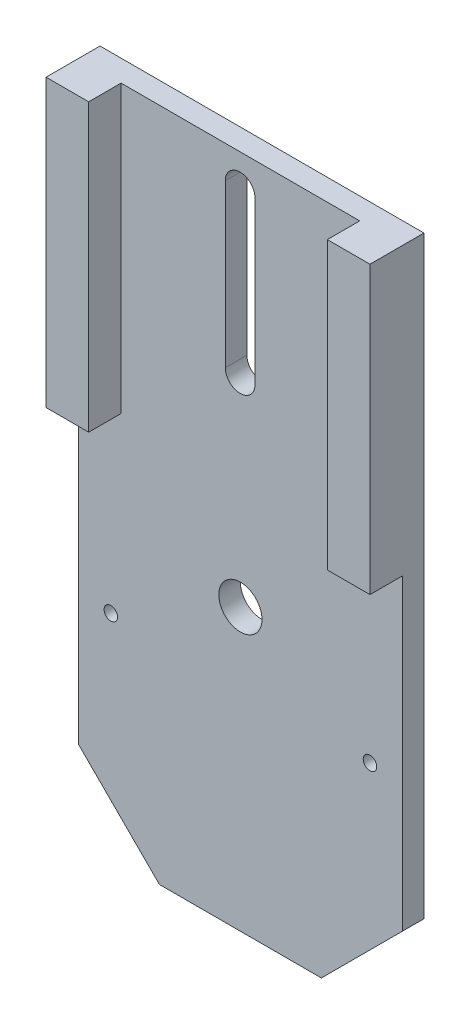
ISO-10303-21;
HEADER;
FILE_DESCRIPTION(('STEP AP214'),'2;1');
FILE_NAME('part.step','',(''),(''),'','','');
FILE_SCHEMA(('AUTOMOTIVE_DESIGN { 1 0 10303 214 1 1 1 1 }'));
ENDSEC;
DATA;
#1=APPLICATION_CONTEXT('core data for automotive mechanical design processes');
#2=APPLICATION_PROTOCOL_DEFINITION('international standard','automotive_design',2000,#1);
#3=PRODUCT_CONTEXT('',#1,'mechanical');
#4=PRODUCT('Part','Part','',(#3));
#5=PRODUCT_RELATED_PRODUCT_CATEGORY('part','',(#4));
#6=PRODUCT_DEFINITION_FORMATION('','',#4);
#7=PRODUCT_DEFINITION_CONTEXT('part definition',#1,'design');
#8=PRODUCT_DEFINITION('design','',#6,#7);
#9=PRODUCT_DEFINITION_SHAPE('','',#8);
#10=(LENGTH_UNIT() NAMED_UNIT(*) SI_UNIT(.MILLI.,.METRE.));
#11=(NAMED_UNIT(*) PLANE_ANGLE_UNIT() SI_UNIT($,.RADIAN.));
#12=(NAMED_UNIT(*) SI_UNIT($,.STERADIAN.) SOLID_ANGLE_UNIT());
#13=UNCERTAINTY_MEASURE_WITH_UNIT(LENGTH_MEASURE(1.E-05),#10,'distance_accuracy_value','');
#14=(GEOMETRIC_REPRESENTATION_CONTEXT(3) GLOBAL_UNCERTAINTY_ASSIGNED_CONTEXT((#13)) GLOBAL_UNIT_ASSIGNED_CONTEXT((#10,
#11,#12)) REPRESENTATION_CONTEXT('',''));
#15=CARTESIAN_POINT('',(0.,0.,0.));
#16=DIRECTION('',(0.,0.,1.));
#17=DIRECTION('',(1.,0.,0.));
#18=AXIS2_PLACEMENT_3D('',#15,#16,#17);
#19=CARTESIAN_POINT('',(0.,125.,10.));
#20=DIRECTION('',(0.,0.,-1.));
#21=DIRECTION('',(-1.,0.,0.));
#22=AXIS2_PLACEMENT_3D('',#19,#20,#21);
#23=PLANE('',#22);
#24=DIRECTION('',(-1.,0.,0.));
#25=VECTOR('',#24,1.);
#26=CARTESIAN_POINT('',(60.,72.,10.));
#27=LINE('',#26,#25);
#28=CARTESIAN_POINT('',(7.9,72.,10.));
#29=VERTEX_POINT('',#28);
#30=CARTESIAN_POINT('',(0.,72.,10.));
#31=VERTEX_POINT('',#30);
#32=EDGE_CURVE('E212',#29,#31,#27,.T.);
#33=ORIENTED_EDGE('',*,*,#32,.F.);
#34=DIRECTION('',(0.,1.,0.));
#35=VECTOR('',#34,1.);
#36=CARTESIAN_POINT('',(7.9,70.,10.));
#37=LINE('',#36,#35);
#38=CARTESIAN_POINT('',(7.9,125.,10.));
#39=VERTEX_POINT('',#38);
#40=EDGE_CURVE('E183',#29,#39,#37,.T.);
#41=ORIENTED_EDGE('',*,*,#40,.T.);
#42=DIRECTION('',(-1.,0.,0.));
#43=VECTOR('',#42,1.);
#44=CARTESIAN_POINT('',(0.,125.,10.));
#45=LINE('',#44,#43);
#46=CARTESIAN_POINT('',(0.,125.,10.));
#47=VERTEX_POINT('',#46);
#48=EDGE_CURVE('E238',#39,#47,#45,.T.);
#49=ORIENTED_EDGE('',*,*,#48,.T.);
#50=DIRECTION('',(0.,-1.,0.));
#51=VECTOR('',#50,1.);
#52=CARTESIAN_POINT('',(0.,0.,10.));
#53=LINE('',#52,#51);
#54=EDGE_CURVE('E232',#47,#31,#53,.T.);
#55=ORIENTED_EDGE('',*,*,#54,.T.);
#56=EDGE_LOOP('',(#33,#41,#49,#55));
#57=FACE_BOUND('',#56,.T.);
#58=ADVANCED_FACE('F34',(#57),#23,.F.);
#59=CARTESIAN_POINT('',(60.,72.,10.));
#60=DIRECTION('',(0.,1.,0.));
#61=DIRECTION('',(0.,0.,1.));
#62=AXIS2_PLACEMENT_3D('',#59,#60,#61);
#63=PLANE('',#62);
#64=DIRECTION('',(-1.,0.,0.));
#65=VECTOR('',#64,1.);
#66=CARTESIAN_POINT('',(60.,72.,4.));
#67=LINE('',#66,#65);
#68=CARTESIAN_POINT('',(7.9,72.,4.));
#69=VERTEX_POINT('',#68);
#70=CARTESIAN_POINT('',(0.,72.,4.));
#71=VERTEX_POINT('',#70);
#72=EDGE_CURVE('E224',#69,#71,#67,.T.);
#73=ORIENTED_EDGE('',*,*,#72,.F.);
#74=DIRECTION('',(0.,0.,1.));
#75=VECTOR('',#74,1.);
#76=CARTESIAN_POINT('',(7.9,72.,10.));
#77=LINE('',#76,#75);
#78=EDGE_CURVE('E279',#69,#29,#77,.T.);
#79=ORIENTED_EDGE('',*,*,#78,.T.);
#80=ORIENTED_EDGE('',*,*,#32,.T.);
#81=DIRECTION('',(0.,0.,-1.));
#82=VECTOR('',#81,1.);
#83=CARTESIAN_POINT('',(0.,72.,10.));
#84=LINE('',#83,#82);
#85=EDGE_CURVE('E204',#31,#71,#84,.T.);
#86=ORIENTED_EDGE('',*,*,#85,.T.);
#87=EDGE_LOOP('',(#73,#79,#80,#86));
#88=FACE_BOUND('',#87,.T.);
#89=ADVANCED_FACE('F305',(#88),#63,.F.);
#90=CARTESIAN_POINT('',(0.,0.,10.));
#91=DIRECTION('',(1.,0.,0.));
#92=DIRECTION('',(0.,0.,-1.));
#93=AXIS2_PLACEMENT_3D('',#90,#91,#92);
#94=PLANE('',#93);
#95=DIRECTION('',(0.,-1.,0.));
#96=VECTOR('',#95,1.);
#97=CARTESIAN_POINT('',(0.,0.,0.));
#98=LINE('',#97,#96);
#99=CARTESIAN_POINT('',(0.,125.,0.));
#100=VERTEX_POINT('',#99);
#101=CARTESIAN_POINT('',(0.,15.0000000000001,0.));
#102=VERTEX_POINT('',#101);
#103=EDGE_CURVE('E231',#100,#102,#98,.T.);
#104=ORIENTED_EDGE('',*,*,#103,.T.);
#105=DIRECTION('',(0.,0.,1.));
#106=VECTOR('',#105,1.);
#107=CARTESIAN_POINT('',(0.,15.0000000000001,10.));
#108=LINE('',#107,#106);
#109=CARTESIAN_POINT('',(0.,15.0000000000001,4.));
#110=VERTEX_POINT('',#109);
#111=EDGE_CURVE('E267',#102,#110,#108,.T.);
#112=ORIENTED_EDGE('',*,*,#111,.T.);
#113=DIRECTION('',(0.,-1.,0.));
#114=VECTOR('',#113,1.);
#115=CARTESIAN_POINT('',(0.,0.,4.));
#116=LINE('',#115,#114);
#117=EDGE_CURVE('E209',#71,#110,#116,.T.);
#118=ORIENTED_EDGE('',*,*,#117,.F.);
#119=ORIENTED_EDGE('',*,*,#85,.F.);
#120=ORIENTED_EDGE('',*,*,#54,.F.);
#121=DIRECTION('',(0.,0.,-1.));
#122=VECTOR('',#121,1.);
#123=CARTESIAN_POINT('',(0.,125.,10.));
#124=LINE('',#123,#122);
#125=EDGE_CURVE('E242',#47,#100,#124,.T.);
#126=ORIENTED_EDGE('',*,*,#125,.T.);
#127=EDGE_LOOP('',(#104,#112,#118,#119,#120,#126));
#128=FACE_BOUND('',#127,.T.);
#129=ADVANCED_FACE('F312',(#128),#94,.F.);
#130=CARTESIAN_POINT('',(0.,0.,10.));
#131=DIRECTION('',(0.,1.,0.));
#132=DIRECTION('',(0.,0.,1.));
#133=AXIS2_PLACEMENT_3D('',#130,#131,#132);
#134=PLANE('',#133);
#135=DIRECTION('',(-1.,0.,0.));
#136=VECTOR('',#135,1.);
#137=CARTESIAN_POINT('',(60.,0.,4.));
#138=LINE('',#137,#136);
#139=CARTESIAN_POINT('',(44.9999999999999,0.,4.));
#140=VERTEX_POINT('',#139);
#141=CARTESIAN_POINT('',(15.,0.,4.));
#142=VERTEX_POINT('',#141);
#143=EDGE_CURVE('E217',#140,#142,#138,.T.);
#144=ORIENTED_EDGE('',*,*,#143,.T.);
#145=DIRECTION('',(0.,0.,-1.));
#146=VECTOR('',#145,1.);
#147=CARTESIAN_POINT('',(15.,0.,10.));
#148=LINE('',#147,#146);
#149=CARTESIAN_POINT('',(15.,0.,0.));
#150=VERTEX_POINT('',#149);
#151=EDGE_CURVE('E260',#142,#150,#148,.T.);
#152=ORIENTED_EDGE('',*,*,#151,.T.);
#153=DIRECTION('',(1.,0.,0.));
#154=VECTOR('',#153,1.);
#155=CARTESIAN_POINT('',(0.,0.,0.));
#156=LINE('',#155,#154);
#157=CARTESIAN_POINT('',(44.9999999999999,0.,0.));
#158=VERTEX_POINT('',#157);
#159=EDGE_CURVE('E245',#150,#158,#156,.T.);
#160=ORIENTED_EDGE('',*,*,#159,.T.);
#161=DIRECTION('',(0.,0.,1.));
#162=VECTOR('',#161,1.);
#163=CARTESIAN_POINT('',(44.9999999999999,0.,10.));
#164=LINE('',#163,#162);
#165=EDGE_CURVE('E256',#158,#140,#164,.T.);
#166=ORIENTED_EDGE('',*,*,#165,.T.);
#167=EDGE_LOOP('',(#144,#152,#160,#166));
#168=FACE_BOUND('',#167,.T.);
#169=ADVANCED_FACE('F365',(#168),#134,.F.);
#170=CARTESIAN_POINT('',(60.,0.,10.));
#171=DIRECTION('',(-1.,0.,0.));
#172=DIRECTION('',(0.,0.,1.));
#173=AXIS2_PLACEMENT_3D('',#170,#171,#172);
#174=PLANE('',#173);
#175=DIRECTION('',(0.,-1.,0.));
#176=VECTOR('',#175,1.);
#177=CARTESIAN_POINT('',(60.,0.,4.));
#178=LINE('',#177,#176);
#179=CARTESIAN_POINT('',(60.,72.,4.));
#180=VERTEX_POINT('',#179);
#181=CARTESIAN_POINT('',(60.,15.,4.));
#182=VERTEX_POINT('',#181);
#183=EDGE_CURVE('E208',#180,#182,#178,.T.);
#184=ORIENTED_EDGE('',*,*,#183,.T.);
#185=DIRECTION('',(0.,0.,-1.));
#186=VECTOR('',#185,1.);
#187=CARTESIAN_POINT('',(60.,15.,10.));
#188=LINE('',#187,#186);
#189=CARTESIAN_POINT('',(60.,15.,0.));
#190=VERTEX_POINT('',#189);
#191=EDGE_CURVE('E273',#182,#190,#188,.T.);
#192=ORIENTED_EDGE('',*,*,#191,.T.);
#193=DIRECTION('',(0.,1.,0.));
#194=VECTOR('',#193,1.);
#195=CARTESIAN_POINT('',(60.,0.,0.));
#196=LINE('',#195,#194);
#197=CARTESIAN_POINT('',(60.,125.,0.));
#198=VERTEX_POINT('',#197);
#199=EDGE_CURVE('E248',#190,#198,#196,.T.);
#200=ORIENTED_EDGE('',*,*,#199,.T.);
#201=DIRECTION('',(0.,0.,-1.));
#202=VECTOR('',#201,1.);
#203=CARTESIAN_POINT('',(60.,125.,10.));
#204=LINE('',#203,#202);
#205=CARTESIAN_POINT('',(60.,125.,10.));
#206=VERTEX_POINT('',#205);
#207=EDGE_CURVE('E253',#206,#198,#204,.T.);
#208=ORIENTED_EDGE('',*,*,#207,.F.);
#209=DIRECTION('',(0.,1.,0.));
#210=VECTOR('',#209,1.);
#211=CARTESIAN_POINT('',(60.,0.,10.));
#212=LINE('',#211,#210);
#213=CARTESIAN_POINT('',(60.,72.,10.));
#214=VERTEX_POINT('',#213);
#215=EDGE_CURVE('E235',#214,#206,#212,.T.);
#216=ORIENTED_EDGE('',*,*,#215,.F.);
#217=DIRECTION('',(0.,0.,-1.));
#218=VECTOR('',#217,1.);
#219=CARTESIAN_POINT('',(60.,72.,10.));
#220=LINE('',#219,#218);
#221=EDGE_CURVE('E205',#214,#180,#220,.T.);
#222=ORIENTED_EDGE('',*,*,#221,.T.);
#223=EDGE_LOOP('',(#184,#192,#200,#208,#216,#222));
#224=FACE_BOUND('',#223,.T.);
#225=ADVANCED_FACE('F327',(#224),#174,.F.);
#226=CARTESIAN_POINT('',(0.,125.,10.));
#227=DIRECTION('',(0.,-1.,0.));
#228=DIRECTION('',(0.,0.,-1.));
#229=AXIS2_PLACEMENT_3D('',#226,#227,#228);
#230=PLANE('',#229);
#231=ORIENTED_EDGE('',*,*,#48,.F.);
#232=DIRECTION('',(0.,0.,1.));
#233=VECTOR('',#232,1.);
#234=CARTESIAN_POINT('',(7.9,125.,10.));
#235=LINE('',#234,#233);
#236=CARTESIAN_POINT('',(7.9,125.,4.));
#237=VERTEX_POINT('',#236);
#238=EDGE_CURVE('E173',#237,#39,#235,.T.);
#239=ORIENTED_EDGE('',*,*,#238,.F.);
#240=DIRECTION('',(-1.,0.,0.));
#241=VECTOR('',#240,1.);
#242=CARTESIAN_POINT('',(7.9,125.,4.));
#243=LINE('',#242,#241);
#244=CARTESIAN_POINT('',(52.1,125.,4.));
#245=VERTEX_POINT('',#244);
#246=EDGE_CURVE('E180',#245,#237,#243,.T.);
#247=ORIENTED_EDGE('',*,*,#246,.F.);
#248=DIRECTION('',(0.,0.,-1.));
#249=VECTOR('',#248,1.);
#250=CARTESIAN_POINT('',(52.1,125.,10.));
#251=LINE('',#250,#249);
#252=CARTESIAN_POINT('',(52.1,125.,10.));
#253=VERTEX_POINT('',#252);
#254=EDGE_CURVE('E177',#253,#245,#251,.T.);
#255=ORIENTED_EDGE('',*,*,#254,.F.);
#256=EDGE_CURVE('E239',#206,#253,#45,.T.);
#257=ORIENTED_EDGE('',*,*,#256,.F.);
#258=ORIENTED_EDGE('',*,*,#207,.T.);
#259=DIRECTION('',(-1.,0.,0.));
#260=VECTOR('',#259,1.);
#261=CARTESIAN_POINT('',(0.,125.,0.));
#262=LINE('',#261,#260);
#263=EDGE_CURVE('E236',#198,#100,#262,.T.);
#264=ORIENTED_EDGE('',*,*,#263,.T.);
#265=ORIENTED_EDGE('',*,*,#125,.F.);
#266=EDGE_LOOP('',(#231,#239,#247,#255,#257,#258,#264,#265));
#267=FACE_BOUND('',#266,.T.);
#268=ADVANCED_FACE('F320',(#267),#230,.F.);
#269=ORIENTED_EDGE('',*,*,#256,.T.);
#270=DIRECTION('',(0.,1.,0.));
#271=VECTOR('',#270,1.);
#272=CARTESIAN_POINT('',(52.1,70.,10.));
#273=LINE('',#272,#271);
#274=CARTESIAN_POINT('',(52.1,72.,10.));
#275=VERTEX_POINT('',#274);
#276=EDGE_CURVE('E189',#275,#253,#273,.T.);
#277=ORIENTED_EDGE('',*,*,#276,.F.);
#278=EDGE_CURVE('E225',#214,#275,#27,.T.);
#279=ORIENTED_EDGE('',*,*,#278,.F.);
#280=ORIENTED_EDGE('',*,*,#215,.T.);
#281=EDGE_LOOP('',(#269,#277,#279,#280));
#282=FACE_BOUND('',#281,.T.);
#283=ADVANCED_FACE('F308',(#282),#23,.F.);
#284=CARTESIAN_POINT('',(0.,125.,0.));
#285=DIRECTION('',(0.,0.,-1.));
#286=DIRECTION('',(-1.,0.,0.));
#287=AXIS2_PLACEMENT_3D('',#284,#285,#286);
#288=PLANE('',#287);
#289=CARTESIAN_POINT('',(29.9525777419631,119.,0.));
#290=DIRECTION('',(0.,0.,-1.));
#291=DIRECTION('',(-1.,0.,0.));
#292=AXIS2_PLACEMENT_3D('',#289,#290,#291);
#293=CIRCLE('',#292,2.75);
#294=CARTESIAN_POINT('',(27.2025777419631,119.,0.));
#295=VERTEX_POINT('',#294);
#296=CARTESIAN_POINT('',(32.7025777419631,119.,0.));
#297=VERTEX_POINT('',#296);
#298=EDGE_CURVE('E49',#295,#297,#293,.T.);
#299=ORIENTED_EDGE('',*,*,#298,.F.);
#300=DIRECTION('',(0.,1.,0.));
#301=VECTOR('',#300,1.);
#302=CARTESIAN_POINT('',(27.2025777419631,119.,0.));
#303=LINE('',#302,#301);
#304=CARTESIAN_POINT('',(27.2025777419631,89.,0.));
#305=VERTEX_POINT('',#304);
#306=EDGE_CURVE('E166',#305,#295,#303,.T.);
#307=ORIENTED_EDGE('',*,*,#306,.F.);
#308=CARTESIAN_POINT('',(29.9525777419631,89.,0.));
#309=DIRECTION('',(0.,0.,-1.));
#310=DIRECTION('',(-1.,0.,0.));
#311=AXIS2_PLACEMENT_3D('',#308,#309,#310);
#312=CIRCLE('',#311,2.75000000000001);
#313=CARTESIAN_POINT('',(32.7025777419631,89.,0.));
#314=VERTEX_POINT('',#313);
#315=EDGE_CURVE('E150',#314,#305,#312,.T.);
#316=ORIENTED_EDGE('',*,*,#315,.F.);
#317=DIRECTION('',(0.,-1.,0.));
#318=VECTOR('',#317,1.);
#319=CARTESIAN_POINT('',(32.7025777419631,119.,0.));
#320=LINE('',#319,#318);
#321=EDGE_CURVE('E159',#297,#314,#320,.T.);
#322=ORIENTED_EDGE('',*,*,#321,.F.);
#323=EDGE_LOOP('',(#299,#307,#316,#322));
#324=FACE_BOUND('',#323,.T.);
#325=CARTESIAN_POINT('',(6.,39.,0.));
#326=DIRECTION('',(0.,0.,1.));
#327=DIRECTION('',(1.,0.,0.));
#328=AXIS2_PLACEMENT_3D('',#325,#326,#327);
#329=CIRCLE('',#328,1.25);
#330=CARTESIAN_POINT('',(7.25,39.,0.));
#331=VERTEX_POINT('',#330);
#332=EDGE_CURVE('E195',#331,#331,#329,.T.);
#333=ORIENTED_EDGE('',*,*,#332,.T.);
#334=EDGE_LOOP('',(#333));
#335=FACE_BOUND('',#334,.T.);
#336=CARTESIAN_POINT('',(54.,39.,0.));
#337=DIRECTION('',(0.,0.,1.));
#338=DIRECTION('',(1.,0.,0.));
#339=AXIS2_PLACEMENT_3D('',#336,#337,#338);
#340=CIRCLE('',#339,1.25);
#341=CARTESIAN_POINT('',(55.25,39.,0.));
#342=VERTEX_POINT('',#341);
#343=EDGE_CURVE('E201',#342,#342,#340,.T.);
#344=ORIENTED_EDGE('',*,*,#343,.T.);
#345=EDGE_LOOP('',(#344));
#346=FACE_BOUND('',#345,.T.);
#347=CARTESIAN_POINT('',(30.,52.,0.));
#348=DIRECTION('',(0.,0.,1.));
#349=DIRECTION('',(1.,0.,0.));
#350=AXIS2_PLACEMENT_3D('',#347,#348,#349);
#351=CIRCLE('',#350,4.00000000000001);
#352=CARTESIAN_POINT('',(34.,52.,0.));
#353=VERTEX_POINT('',#352);
#354=EDGE_CURVE('E228',#353,#353,#351,.T.);
#355=ORIENTED_EDGE('',*,*,#354,.T.);
#356=EDGE_LOOP('',(#355));
#357=FACE_BOUND('',#356,.T.);
#358=ORIENTED_EDGE('',*,*,#159,.F.);
#359=DIRECTION('',(0.707106781186546,-0.707106781186549,0.));
#360=VECTOR('',#359,1.);
#361=CARTESIAN_POINT('',(-55.,70.0000000000002,0.));
#362=LINE('',#361,#360);
#363=EDGE_CURVE('E265',#150,#102,#362,.F.);
#364=ORIENTED_EDGE('',*,*,#363,.T.);
#365=ORIENTED_EDGE('',*,*,#103,.F.);
#366=ORIENTED_EDGE('',*,*,#263,.F.);
#367=ORIENTED_EDGE('',*,*,#199,.F.);
#368=DIRECTION('',(0.707106781186549,0.707106781186546,0.));
#369=VECTOR('',#368,1.);
#370=CARTESIAN_POINT('',(84.9999999999999,39.9999999999998,0.));
#371=LINE('',#370,#369);
#372=EDGE_CURVE('E263',#190,#158,#371,.F.);
#373=ORIENTED_EDGE('',*,*,#372,.T.);
#374=EDGE_LOOP('',(#358,#364,#365,#366,#367,#373));
#375=FACE_BOUND('',#374,.T.);
#376=ADVANCED_FACE('F163',(#324,#335,#346,#357,#375),#288,.T.);
#377=CARTESIAN_POINT('',(30.,52.,0.));
#378=DIRECTION('',(0.,0.,1.));
#379=DIRECTION('',(1.,0.,0.));
#380=AXIS2_PLACEMENT_3D('',#377,#378,#379);
#381=CYLINDRICAL_SURFACE('',#380,4.00000000000001);
#382=CARTESIAN_POINT('',(30.,52.,4.));
#383=DIRECTION('',(0.,0.,-1.));
#384=DIRECTION('',(-1.,0.,0.));
#385=AXIS2_PLACEMENT_3D('',#382,#383,#384);
#386=CIRCLE('',#385,4.00000000000001);
#387=CARTESIAN_POINT('',(26.,52.,4.));
#388=VERTEX_POINT('',#387);
#389=EDGE_CURVE('E220',#388,#388,#386,.F.);
#390=ORIENTED_EDGE('',*,*,#389,.T.);
#391=EDGE_LOOP('',(#390));
#392=FACE_BOUND('',#391,.T.);
#393=ORIENTED_EDGE('',*,*,#354,.F.);
#394=EDGE_LOOP('',(#393));
#395=FACE_BOUND('',#394,.T.);
#396=ADVANCED_FACE('F326',(#392,#395),#381,.F.);
#397=CARTESIAN_POINT('',(60.,0.,4.));
#398=DIRECTION('',(0.,0.,-1.));
#399=DIRECTION('',(-1.,0.,0.));
#400=AXIS2_PLACEMENT_3D('',#397,#398,#399);
#401=PLANE('',#400);
#402=DIRECTION('',(0.,1.,0.));
#403=VECTOR('',#402,1.);
#404=CARTESIAN_POINT('',(27.2025777419631,0.,4.));
#405=LINE('',#404,#403);
#406=CARTESIAN_POINT('',(27.2025777419631,89.,4.));
#407=VERTEX_POINT('',#406);
#408=CARTESIAN_POINT('',(27.2025777419631,119.,4.));
#409=VERTEX_POINT('',#408);
#410=EDGE_CURVE('E42',#407,#409,#405,.T.);
#411=ORIENTED_EDGE('',*,*,#410,.T.);
#412=CARTESIAN_POINT('',(29.9525777419631,119.,4.));
#413=DIRECTION('',(0.,0.,-1.));
#414=DIRECTION('',(-1.,0.,0.));
#415=AXIS2_PLACEMENT_3D('',#412,#413,#414);
#416=CIRCLE('',#415,2.75);
#417=CARTESIAN_POINT('',(32.7025777419631,119.,4.));
#418=VERTEX_POINT('',#417);
#419=EDGE_CURVE('E11',#409,#418,#416,.T.);
#420=ORIENTED_EDGE('',*,*,#419,.T.);
#421=DIRECTION('',(0.,-1.,0.));
#422=VECTOR('',#421,1.);
#423=CARTESIAN_POINT('',(32.7025777419631,0.,4.));
#424=LINE('',#423,#422);
#425=CARTESIAN_POINT('',(32.7025777419631,89.,4.));
#426=VERTEX_POINT('',#425);
#427=EDGE_CURVE('E282',#418,#426,#424,.T.);
#428=ORIENTED_EDGE('',*,*,#427,.T.);
#429=CARTESIAN_POINT('',(29.9525777419631,89.,4.));
#430=DIRECTION('',(0.,0.,-1.));
#431=DIRECTION('',(-1.,0.,0.));
#432=AXIS2_PLACEMENT_3D('',#429,#430,#431);
#433=CIRCLE('',#432,2.75000000000001);
#434=EDGE_CURVE('E153',#426,#407,#433,.T.);
#435=ORIENTED_EDGE('',*,*,#434,.T.);
#436=EDGE_LOOP('',(#411,#420,#428,#435));
#437=FACE_BOUND('',#436,.T.);
#438=DIRECTION('',(0.,1.,0.));
#439=VECTOR('',#438,1.);
#440=CARTESIAN_POINT('',(7.9,70.,4.));
#441=LINE('',#440,#439);
#442=EDGE_CURVE('E184',#69,#237,#441,.T.);
#443=ORIENTED_EDGE('',*,*,#442,.F.);
#444=ORIENTED_EDGE('',*,*,#72,.T.);
#445=ORIENTED_EDGE('',*,*,#117,.T.);
#446=DIRECTION('',(-0.707106781186546,0.707106781186549,0.));
#447=VECTOR('',#446,1.);
#448=CARTESIAN_POINT('',(15.,0.,4.));
#449=LINE('',#448,#447);
#450=EDGE_CURVE('E271',#110,#142,#449,.F.);
#451=ORIENTED_EDGE('',*,*,#450,.T.);
#452=ORIENTED_EDGE('',*,*,#143,.F.);
#453=DIRECTION('',(-0.707106781186549,-0.707106781186546,0.));
#454=VECTOR('',#453,1.);
#455=CARTESIAN_POINT('',(60.,15.,4.));
#456=LINE('',#455,#454);
#457=EDGE_CURVE('E269',#140,#182,#456,.F.);
#458=ORIENTED_EDGE('',*,*,#457,.T.);
#459=ORIENTED_EDGE('',*,*,#183,.F.);
#460=CARTESIAN_POINT('',(52.1,72.,4.));
#461=VERTEX_POINT('',#460);
#462=EDGE_CURVE('E221',#180,#461,#67,.T.);
#463=ORIENTED_EDGE('',*,*,#462,.T.);
#464=DIRECTION('',(0.,1.,0.));
#465=VECTOR('',#464,1.);
#466=CARTESIAN_POINT('',(52.1,70.,4.));
#467=LINE('',#466,#465);
#468=EDGE_CURVE('E187',#461,#245,#467,.T.);
#469=ORIENTED_EDGE('',*,*,#468,.T.);
#470=ORIENTED_EDGE('',*,*,#246,.T.);
#471=EDGE_LOOP('',(#443,#444,#445,#451,#452,#458,#459,#463,#469,#470));
#472=FACE_BOUND('',#471,.T.);
#473=CARTESIAN_POINT('',(6.,39.,4.));
#474=DIRECTION('',(0.,0.,1.));
#475=DIRECTION('',(1.,0.,0.));
#476=AXIS2_PLACEMENT_3D('',#473,#474,#475);
#477=CIRCLE('',#476,1.24999999999999);
#478=CARTESIAN_POINT('',(7.24999999999999,39.,4.));
#479=VERTEX_POINT('',#478);
#480=EDGE_CURVE('E186',#479,#479,#477,.T.);
#481=ORIENTED_EDGE('',*,*,#480,.F.);
#482=EDGE_LOOP('',(#481));
#483=FACE_BOUND('',#482,.T.);
#484=CARTESIAN_POINT('',(54.,39.,4.));
#485=DIRECTION('',(0.,0.,1.));
#486=DIRECTION('',(1.,0.,0.));
#487=AXIS2_PLACEMENT_3D('',#484,#485,#486);
#488=CIRCLE('',#487,1.24999999999999);
#489=CARTESIAN_POINT('',(55.25,39.,4.));
#490=VERTEX_POINT('',#489);
#491=EDGE_CURVE('E198',#490,#490,#488,.T.);
#492=ORIENTED_EDGE('',*,*,#491,.F.);
#493=EDGE_LOOP('',(#492));
#494=FACE_BOUND('',#493,.T.);
#495=ORIENTED_EDGE('',*,*,#389,.F.);
#496=EDGE_LOOP('',(#495));
#497=FACE_BOUND('',#496,.T.);
#498=ADVANCED_FACE('F286',(#437,#472,#483,#494,#497),#401,.F.);
#499=ORIENTED_EDGE('',*,*,#278,.T.);
#500=DIRECTION('',(0.,0.,-1.));
#501=VECTOR('',#500,1.);
#502=CARTESIAN_POINT('',(52.1,72.,10.));
#503=LINE('',#502,#501);
#504=EDGE_CURVE('E276',#275,#461,#503,.T.);
#505=ORIENTED_EDGE('',*,*,#504,.T.);
#506=ORIENTED_EDGE('',*,*,#462,.F.);
#507=ORIENTED_EDGE('',*,*,#221,.F.);
#508=EDGE_LOOP('',(#499,#505,#506,#507));
#509=FACE_BOUND('',#508,.T.);
#510=ADVANCED_FACE('F315',(#509),#63,.F.);
#511=CARTESIAN_POINT('',(54.,39.,4.));
#512=DIRECTION('',(0.,0.,1.));
#513=DIRECTION('',(1.,0.,0.));
#514=AXIS2_PLACEMENT_3D('',#511,#512,#513);
#515=CYLINDRICAL_SURFACE('',#514,1.24999999999999);
#516=ORIENTED_EDGE('',*,*,#343,.F.);
#517=EDGE_LOOP('',(#516));
#518=FACE_BOUND('',#517,.T.);
#519=ORIENTED_EDGE('',*,*,#491,.T.);
#520=EDGE_LOOP('',(#519));
#521=FACE_BOUND('',#520,.T.);
#522=ADVANCED_FACE('F378',(#518,#521),#515,.F.);
#523=CARTESIAN_POINT('',(6.,39.,4.));
#524=DIRECTION('',(0.,0.,1.));
#525=DIRECTION('',(1.,0.,0.));
#526=AXIS2_PLACEMENT_3D('',#523,#524,#525);
#527=CYLINDRICAL_SURFACE('',#526,1.24999999999999);
#528=ORIENTED_EDGE('',*,*,#332,.F.);
#529=EDGE_LOOP('',(#528));
#530=FACE_BOUND('',#529,.T.);
#531=ORIENTED_EDGE('',*,*,#480,.T.);
#532=EDGE_LOOP('',(#531));
#533=FACE_BOUND('',#532,.T.);
#534=ADVANCED_FACE('F374',(#530,#533),#527,.F.);
#535=CARTESIAN_POINT('',(15.,0.,10.));
#536=DIRECTION('',(0.707106781186549,0.707106781186546,0.));
#537=DIRECTION('',(-0.707106781186546,0.707106781186549,0.));
#538=AXIS2_PLACEMENT_3D('',#535,#536,#537);
#539=PLANE('',#538);
#540=ORIENTED_EDGE('',*,*,#450,.F.);
#541=ORIENTED_EDGE('',*,*,#111,.F.);
#542=ORIENTED_EDGE('',*,*,#363,.F.);
#543=ORIENTED_EDGE('',*,*,#151,.F.);
#544=EDGE_LOOP('',(#540,#541,#542,#543));
#545=FACE_BOUND('',#544,.T.);
#546=ADVANCED_FACE('F363',(#545),#539,.F.);
#547=CARTESIAN_POINT('',(60.,15.,10.));
#548=DIRECTION('',(-0.707106781186546,0.707106781186549,0.));
#549=DIRECTION('',(-0.707106781186549,-0.707106781186546,0.));
#550=AXIS2_PLACEMENT_3D('',#547,#548,#549);
#551=PLANE('',#550);
#552=ORIENTED_EDGE('',*,*,#457,.F.);
#553=ORIENTED_EDGE('',*,*,#165,.F.);
#554=ORIENTED_EDGE('',*,*,#372,.F.);
#555=ORIENTED_EDGE('',*,*,#191,.F.);
#556=EDGE_LOOP('',(#552,#553,#554,#555));
#557=FACE_BOUND('',#556,.T.);
#558=ADVANCED_FACE('F36',(#557),#551,.F.);
#559=CARTESIAN_POINT('',(7.9,70.,10.));
#560=DIRECTION('',(-1.,0.,0.));
#561=DIRECTION('',(0.,0.,1.));
#562=AXIS2_PLACEMENT_3D('',#559,#560,#561);
#563=PLANE('',#562);
#564=ORIENTED_EDGE('',*,*,#442,.T.);
#565=ORIENTED_EDGE('',*,*,#238,.T.);
#566=ORIENTED_EDGE('',*,*,#40,.F.);
#567=ORIENTED_EDGE('',*,*,#78,.F.);
#568=EDGE_LOOP('',(#564,#565,#566,#567));
#569=FACE_BOUND('',#568,.T.);
#570=ADVANCED_FACE('F300',(#569),#563,.F.);
#571=CARTESIAN_POINT('',(52.1,70.,10.));
#572=DIRECTION('',(1.,0.,0.));
#573=DIRECTION('',(0.,0.,-1.));
#574=AXIS2_PLACEMENT_3D('',#571,#572,#573);
#575=PLANE('',#574);
#576=ORIENTED_EDGE('',*,*,#276,.T.);
#577=ORIENTED_EDGE('',*,*,#254,.T.);
#578=ORIENTED_EDGE('',*,*,#468,.F.);
#579=ORIENTED_EDGE('',*,*,#504,.F.);
#580=EDGE_LOOP('',(#576,#577,#578,#579));
#581=FACE_BOUND('',#580,.T.);
#582=ADVANCED_FACE('F293',(#581),#575,.F.);
#583=CARTESIAN_POINT('',(29.9525777419631,119.,10.));
#584=DIRECTION('',(0.,0.,-1.));
#585=DIRECTION('',(-1.,0.,0.));
#586=AXIS2_PLACEMENT_3D('',#583,#584,#585);
#587=CYLINDRICAL_SURFACE('',#586,2.75);
#588=DIRECTION('',(0.,0.,-1.));
#589=VECTOR('',#588,1.);
#590=CARTESIAN_POINT('',(27.2025777419631,119.,10.));
#591=LINE('',#590,#589);
#592=EDGE_CURVE('E171',#409,#295,#591,.T.);
#593=ORIENTED_EDGE('',*,*,#592,.T.);
#594=ORIENTED_EDGE('',*,*,#298,.T.);
#595=DIRECTION('',(0.,0.,-1.));
#596=VECTOR('',#595,1.);
#597=CARTESIAN_POINT('',(32.7025777419631,119.,10.));
#598=LINE('',#597,#596);
#599=EDGE_CURVE('E156',#418,#297,#598,.T.);
#600=ORIENTED_EDGE('',*,*,#599,.F.);
#601=ORIENTED_EDGE('',*,*,#419,.F.);
#602=EDGE_LOOP('',(#593,#594,#600,#601));
#603=FACE_BOUND('',#602,.T.);
#604=ADVANCED_FACE('F291',(#603),#587,.F.);
#605=CARTESIAN_POINT('',(27.2025777419631,119.,10.));
#606=DIRECTION('',(-1.,0.,0.));
#607=DIRECTION('',(0.,-1.,0.));
#608=AXIS2_PLACEMENT_3D('',#605,#606,#607);
#609=PLANE('',#608);
#610=DIRECTION('',(0.,0.,-1.));
#611=VECTOR('',#610,1.);
#612=CARTESIAN_POINT('',(27.2025777419631,89.,10.));
#613=LINE('',#612,#611);
#614=EDGE_CURVE('E155',#407,#305,#613,.T.);
#615=ORIENTED_EDGE('',*,*,#614,.T.);
#616=ORIENTED_EDGE('',*,*,#306,.T.);
#617=ORIENTED_EDGE('',*,*,#592,.F.);
#618=ORIENTED_EDGE('',*,*,#410,.F.);
#619=EDGE_LOOP('',(#615,#616,#617,#618));
#620=FACE_BOUND('',#619,.T.);
#621=ADVANCED_FACE('F290',(#620),#609,.F.);
#622=CARTESIAN_POINT('',(29.9525777419631,89.,10.));
#623=DIRECTION('',(0.,0.,-1.));
#624=DIRECTION('',(-1.,0.,0.));
#625=AXIS2_PLACEMENT_3D('',#622,#623,#624);
#626=CYLINDRICAL_SURFACE('',#625,2.75000000000001);
#627=DIRECTION('',(0.,0.,-1.));
#628=VECTOR('',#627,1.);
#629=CARTESIAN_POINT('',(32.7025777419631,89.,10.));
#630=LINE('',#629,#628);
#631=EDGE_CURVE('E57',#426,#314,#630,.T.);
#632=ORIENTED_EDGE('',*,*,#631,.T.);
#633=ORIENTED_EDGE('',*,*,#315,.T.);
#634=ORIENTED_EDGE('',*,*,#614,.F.);
#635=ORIENTED_EDGE('',*,*,#434,.F.);
#636=EDGE_LOOP('',(#632,#633,#634,#635));
#637=FACE_BOUND('',#636,.T.);
#638=ADVANCED_FACE('F147',(#637),#626,.F.);
#639=CARTESIAN_POINT('',(32.7025777419631,119.,10.));
#640=DIRECTION('',(1.,0.,0.));
#641=DIRECTION('',(0.,0.,-1.));
#642=AXIS2_PLACEMENT_3D('',#639,#640,#641);
#643=PLANE('',#642);
#644=ORIENTED_EDGE('',*,*,#599,.T.);
#645=ORIENTED_EDGE('',*,*,#321,.T.);
#646=ORIENTED_EDGE('',*,*,#631,.F.);
#647=ORIENTED_EDGE('',*,*,#427,.F.);
#648=EDGE_LOOP('',(#644,#645,#646,#647));
#649=FACE_BOUND('',#648,.T.);
#650=ADVANCED_FACE('F160',(#649),#643,.F.);
#651=CLOSED_SHELL('',(#58,#89,#129,#169,#225,#268,#283,#376,#396,#498,#510,#522,#534,#546,#558,
#570,#582,#604,#621,#638,#650));
#652=MANIFOLD_SOLID_BREP('B2',#651);
#653=ADVANCED_BREP_SHAPE_REPRESENTATION('',(#18,#652),#14);
#654=SHAPE_DEFINITION_REPRESENTATION(#9,#653);
ENDSEC;
END-ISO-10303-21;
